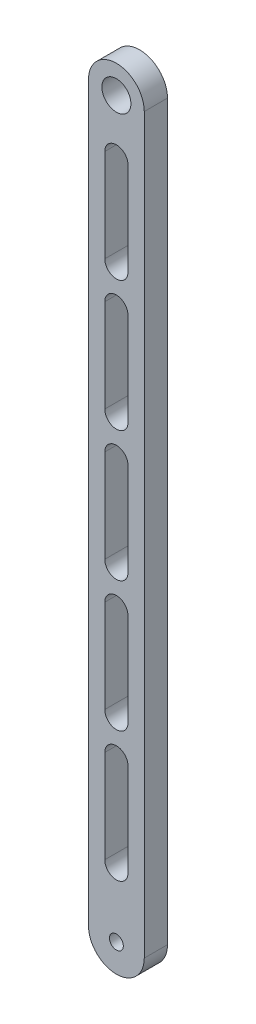
ISO-10303-21;
HEADER;
FILE_DESCRIPTION(('STEP AP214'),'2;1');
FILE_NAME('part.step','',(''),(''),'','','');
FILE_SCHEMA(('AUTOMOTIVE_DESIGN { 1 0 10303 214 1 1 1 1 }'));
ENDSEC;
DATA;
#1=APPLICATION_CONTEXT('core data for automotive mechanical design processes');
#2=APPLICATION_PROTOCOL_DEFINITION('international standard','automotive_design',2000,#1);
#3=PRODUCT_CONTEXT('',#1,'mechanical');
#4=PRODUCT('Part','Part','',(#3));
#5=PRODUCT_RELATED_PRODUCT_CATEGORY('part','',(#4));
#6=PRODUCT_DEFINITION_FORMATION('','',#4);
#7=PRODUCT_DEFINITION_CONTEXT('part definition',#1,'design');
#8=PRODUCT_DEFINITION('design','',#6,#7);
#9=PRODUCT_DEFINITION_SHAPE('','',#8);
#10=(LENGTH_UNIT() NAMED_UNIT(*) SI_UNIT(.MILLI.,.METRE.));
#11=(NAMED_UNIT(*) PLANE_ANGLE_UNIT() SI_UNIT($,.RADIAN.));
#12=(NAMED_UNIT(*) SI_UNIT($,.STERADIAN.) SOLID_ANGLE_UNIT());
#13=UNCERTAINTY_MEASURE_WITH_UNIT(LENGTH_MEASURE(1.E-05),#10,'distance_accuracy_value','');
#14=(GEOMETRIC_REPRESENTATION_CONTEXT(3) GLOBAL_UNCERTAINTY_ASSIGNED_CONTEXT((#13)) GLOBAL_UNIT_ASSIGNED_CONTEXT((#10,
#11,#12)) REPRESENTATION_CONTEXT('',''));
#15=CARTESIAN_POINT('',(0.,0.,0.));
#16=DIRECTION('',(0.,0.,1.));
#17=DIRECTION('',(1.,0.,0.));
#18=AXIS2_PLACEMENT_3D('',#15,#16,#17);
#19=CARTESIAN_POINT('',(0.,0.,6.35));
#20=DIRECTION('',(0.,0.,1.));
#21=DIRECTION('',(1.,0.,0.));
#22=AXIS2_PLACEMENT_3D('',#19,#20,#21);
#23=PLANE('',#22);
#24=CARTESIAN_POINT('',(0.,0.,6.35));
#25=DIRECTION('',(0.,0.,1.));
#26=DIRECTION('',(1.,0.,0.));
#27=AXIS2_PLACEMENT_3D('',#24,#25,#26);
#28=CIRCLE('',#27,1.89864999999999);
#29=CARTESIAN_POINT('',(1.89864999999999,0.,6.35));
#30=VERTEX_POINT('',#29);
#31=EDGE_CURVE('E808',#30,#30,#28,.T.);
#32=ORIENTED_EDGE('',*,*,#31,.F.);
#33=EDGE_LOOP('',(#32));
#34=FACE_BOUND('',#33,.T.);
#35=CARTESIAN_POINT('',(0.,0.,6.35));
#36=DIRECTION('',(0.,0.,1.));
#37=DIRECTION('',(1.,0.,0.));
#38=AXIS2_PLACEMENT_3D('',#35,#36,#37);
#39=CIRCLE('',#38,7.62);
#40=CARTESIAN_POINT('',(-7.62,0.,6.35));
#41=VERTEX_POINT('',#40);
#42=CARTESIAN_POINT('',(7.62,0.,6.35));
#43=VERTEX_POINT('',#42);
#44=EDGE_CURVE('E440',#41,#43,#39,.T.);
#45=ORIENTED_EDGE('',*,*,#44,.T.);
#46=DIRECTION('',(0.,1.,0.));
#47=VECTOR('',#46,1.);
#48=CARTESIAN_POINT('',(7.62,0.,6.35));
#49=LINE('',#48,#47);
#50=CARTESIAN_POINT('',(7.62,200.3806,6.35));
#51=VERTEX_POINT('',#50);
#52=EDGE_CURVE('E444',#43,#51,#49,.T.);
#53=ORIENTED_EDGE('',*,*,#52,.T.);
#54=CARTESIAN_POINT('',(0.,200.3806,6.35));
#55=DIRECTION('',(0.,0.,1.));
#56=DIRECTION('',(1.,0.,0.));
#57=AXIS2_PLACEMENT_3D('',#54,#55,#56);
#58=CIRCLE('',#57,7.62);
#59=CARTESIAN_POINT('',(-7.62,200.3806,6.35));
#60=VERTEX_POINT('',#59);
#61=EDGE_CURVE('E448',#51,#60,#58,.T.);
#62=ORIENTED_EDGE('',*,*,#61,.T.);
#63=DIRECTION('',(0.,-1.,0.));
#64=VECTOR('',#63,1.);
#65=CARTESIAN_POINT('',(-7.62,0.,6.35));
#66=LINE('',#65,#64);
#67=EDGE_CURVE('E451',#60,#41,#66,.T.);
#68=ORIENTED_EDGE('',*,*,#67,.T.);
#69=EDGE_LOOP('',(#45,#53,#62,#68));
#70=FACE_BOUND('',#69,.T.);
#71=CARTESIAN_POINT('',(0.,200.3806,6.35));
#72=DIRECTION('',(0.,0.,1.));
#73=DIRECTION('',(1.,0.,0.));
#74=AXIS2_PLACEMENT_3D('',#71,#72,#73);
#75=CIRCLE('',#74,3.96748);
#76=CARTESIAN_POINT('',(3.96748,200.3806,6.35));
#77=VERTEX_POINT('',#76);
#78=EDGE_CURVE('E432',#77,#77,#75,.T.);
#79=ORIENTED_EDGE('',*,*,#78,.F.);
#80=EDGE_LOOP('',(#79));
#81=FACE_BOUND('',#80,.T.);
#82=DIRECTION('',(0.,-1.,0.));
#83=VECTOR('',#82,1.);
#84=CARTESIAN_POINT('',(-3.175,185.5216,6.35));
#85=LINE('',#84,#83);
#86=CARTESIAN_POINT('',(-3.175,185.5216,6.35));
#87=VERTEX_POINT('',#86);
#88=CARTESIAN_POINT('',(-3.17499999999996,160.1216,6.35));
#89=VERTEX_POINT('',#88);
#90=EDGE_CURVE('E392',#87,#89,#85,.T.);
#91=ORIENTED_EDGE('',*,*,#90,.F.);
#92=CARTESIAN_POINT('',(0.,185.5216,6.35));
#93=DIRECTION('',(0.,0.,1.));
#94=DIRECTION('',(1.,0.,0.));
#95=AXIS2_PLACEMENT_3D('',#92,#93,#94);
#96=CIRCLE('',#95,3.175);
#97=CARTESIAN_POINT('',(3.175,185.5216,6.35));
#98=VERTEX_POINT('',#97);
#99=EDGE_CURVE('E389',#98,#87,#96,.T.);
#100=ORIENTED_EDGE('',*,*,#99,.F.);
#101=DIRECTION('',(0.,1.,0.));
#102=VECTOR('',#101,1.);
#103=CARTESIAN_POINT('',(3.175,185.5216,6.35));
#104=LINE('',#103,#102);
#105=CARTESIAN_POINT('',(3.17499999999997,160.1216,6.35));
#106=VERTEX_POINT('',#105);
#107=EDGE_CURVE('E400',#106,#98,#104,.T.);
#108=ORIENTED_EDGE('',*,*,#107,.F.);
#109=CARTESIAN_POINT('',(0.,160.1216,6.35));
#110=DIRECTION('',(0.,0.,1.));
#111=DIRECTION('',(1.,0.,0.));
#112=AXIS2_PLACEMENT_3D('',#109,#110,#111);
#113=CIRCLE('',#112,3.17499999999996);
#114=EDGE_CURVE('E396',#89,#106,#113,.T.);
#115=ORIENTED_EDGE('',*,*,#114,.F.);
#116=EDGE_LOOP('',(#91,#100,#108,#115));
#117=FACE_BOUND('',#116,.T.);
#118=DIRECTION('',(0.,-1.,0.));
#119=VECTOR('',#118,1.);
#120=CARTESIAN_POINT('',(-3.17499999999997,149.9616,6.35));
#121=LINE('',#120,#119);
#122=CARTESIAN_POINT('',(-3.17499999999997,149.9616,6.35));
#123=VERTEX_POINT('',#122);
#124=CARTESIAN_POINT('',(-3.1749999999996,124.5616,6.35));
#125=VERTEX_POINT('',#124);
#126=EDGE_CURVE('E349',#123,#125,#121,.T.);
#127=ORIENTED_EDGE('',*,*,#126,.F.);
#128=CARTESIAN_POINT('',(3.70296917821771E-13,149.9616,6.35));
#129=DIRECTION('',(0.,0.,1.));
#130=DIRECTION('',(1.,0.,0.));
#131=AXIS2_PLACEMENT_3D('',#128,#129,#130);
#132=CIRCLE('',#131,3.17499999999997);
#133=CARTESIAN_POINT('',(3.17499999999997,149.9616,6.35));
#134=VERTEX_POINT('',#133);
#135=EDGE_CURVE('E346',#134,#123,#132,.T.);
#136=ORIENTED_EDGE('',*,*,#135,.F.);
#137=DIRECTION('',(0.,1.,0.));
#138=VECTOR('',#137,1.);
#139=CARTESIAN_POINT('',(3.17499999999997,149.9616,6.35));
#140=LINE('',#139,#138);
#141=CARTESIAN_POINT('',(3.17499999999997,124.5616,6.35));
#142=VERTEX_POINT('',#141);
#143=EDGE_CURVE('E357',#142,#134,#140,.T.);
#144=ORIENTED_EDGE('',*,*,#143,.F.);
#145=CARTESIAN_POINT('',(3.73329573301861E-13,124.5616,6.35));
#146=DIRECTION('',(0.,0.,1.));
#147=DIRECTION('',(1.,0.,0.));
#148=AXIS2_PLACEMENT_3D('',#145,#146,#147);
#149=CIRCLE('',#148,3.17499999999997);
#150=EDGE_CURVE('E353',#125,#142,#149,.T.);
#151=ORIENTED_EDGE('',*,*,#150,.F.);
#152=EDGE_LOOP('',(#127,#136,#144,#151));
#153=FACE_BOUND('',#152,.T.);
#154=DIRECTION('',(0.,-1.,0.));
#155=VECTOR('',#154,1.);
#156=CARTESIAN_POINT('',(-3.17499999999997,114.4016,6.35));
#157=LINE('',#156,#155);
#158=CARTESIAN_POINT('',(-3.17499999999997,114.4016,6.35));
#159=VERTEX_POINT('',#158);
#160=CARTESIAN_POINT('',(-3.17499999999923,89.0016,6.35));
#161=VERTEX_POINT('',#160);
#162=EDGE_CURVE('E306',#159,#161,#157,.T.);
#163=ORIENTED_EDGE('',*,*,#162,.F.);
#164=CARTESIAN_POINT('',(7.40590725040673E-13,114.4016,6.35));
#165=DIRECTION('',(0.,0.,1.));
#166=DIRECTION('',(1.,0.,0.));
#167=AXIS2_PLACEMENT_3D('',#164,#165,#166);
#168=CIRCLE('',#167,3.17499999999997);
#169=CARTESIAN_POINT('',(3.17499999999997,114.4016,6.35));
#170=VERTEX_POINT('',#169);
#171=EDGE_CURVE('E303',#170,#159,#168,.T.);
#172=ORIENTED_EDGE('',*,*,#171,.F.);
#173=DIRECTION('',(0.,1.,0.));
#174=VECTOR('',#173,1.);
#175=CARTESIAN_POINT('',(3.17499999999997,114.4016,6.35));
#176=LINE('',#175,#174);
#177=CARTESIAN_POINT('',(3.17499999999998,89.0016,6.35));
#178=VERTEX_POINT('',#177);
#179=EDGE_CURVE('E314',#178,#170,#176,.T.);
#180=ORIENTED_EDGE('',*,*,#179,.F.);
#181=CARTESIAN_POINT('',(7.43623380520762E-13,89.0016,6.35));
#182=DIRECTION('',(0.,0.,1.));
#183=DIRECTION('',(1.,0.,0.));
#184=AXIS2_PLACEMENT_3D('',#181,#182,#183);
#185=CIRCLE('',#184,3.17499999999997);
#186=EDGE_CURVE('E310',#161,#178,#185,.T.);
#187=ORIENTED_EDGE('',*,*,#186,.F.);
#188=EDGE_LOOP('',(#163,#172,#180,#187));
#189=FACE_BOUND('',#188,.T.);
#190=DIRECTION('',(0.,-1.,0.));
#191=VECTOR('',#190,1.);
#192=CARTESIAN_POINT('',(-3.17499999999998,78.8416,6.35));
#193=LINE('',#192,#191);
#194=CARTESIAN_POINT('',(-3.17499999999998,78.8416,6.35));
#195=VERTEX_POINT('',#194);
#196=CARTESIAN_POINT('',(-3.17499999999886,53.4416,6.35));
#197=VERTEX_POINT('',#196);
#198=EDGE_CURVE('E264',#195,#197,#193,.T.);
#199=ORIENTED_EDGE('',*,*,#198,.F.);
#200=CARTESIAN_POINT('',(1.11088453225957E-12,78.8416,6.35));
#201=DIRECTION('',(0.,0.,1.));
#202=DIRECTION('',(1.,0.,0.));
#203=AXIS2_PLACEMENT_3D('',#200,#201,#202);
#204=CIRCLE('',#203,3.17499999999998);
#205=CARTESIAN_POINT('',(3.17499999999998,78.8416,6.35));
#206=VERTEX_POINT('',#205);
#207=EDGE_CURVE('E261',#206,#195,#204,.T.);
#208=ORIENTED_EDGE('',*,*,#207,.F.);
#209=DIRECTION('',(0.,1.,0.));
#210=VECTOR('',#209,1.);
#211=CARTESIAN_POINT('',(3.17499999999998,78.8416,6.35));
#212=LINE('',#211,#210);
#213=CARTESIAN_POINT('',(3.17499999999998,53.4416,6.35));
#214=VERTEX_POINT('',#213);
#215=EDGE_CURVE('E271',#214,#206,#212,.T.);
#216=ORIENTED_EDGE('',*,*,#215,.F.);
#217=CARTESIAN_POINT('',(1.11391718773966E-12,53.4416,6.35));
#218=DIRECTION('',(0.,0.,1.));
#219=DIRECTION('',(1.,0.,0.));
#220=AXIS2_PLACEMENT_3D('',#217,#218,#219);
#221=CIRCLE('',#220,3.17499999999998);
#222=EDGE_CURVE('E268',#197,#214,#221,.T.);
#223=ORIENTED_EDGE('',*,*,#222,.F.);
#224=EDGE_LOOP('',(#199,#208,#216,#223));
#225=FACE_BOUND('',#224,.T.);
#226=DIRECTION('',(0.,-1.,0.));
#227=VECTOR('',#226,1.);
#228=CARTESIAN_POINT('',(-3.17499999999998,43.2816,6.35));
#229=LINE('',#228,#227);
#230=CARTESIAN_POINT('',(-3.17499999999998,43.2816,6.35));
#231=VERTEX_POINT('',#230);
#232=CARTESIAN_POINT('',(-3.1749999999985,17.8816,6.35));
#233=VERTEX_POINT('',#232);
#234=EDGE_CURVE('E218',#231,#233,#229,.T.);
#235=ORIENTED_EDGE('',*,*,#234,.F.);
#236=CARTESIAN_POINT('',(1.48117833947848E-12,43.2816,6.35));
#237=DIRECTION('',(0.,0.,1.));
#238=DIRECTION('',(1.,0.,0.));
#239=AXIS2_PLACEMENT_3D('',#236,#237,#238);
#240=CIRCLE('',#239,3.17499999999998);
#241=CARTESIAN_POINT('',(3.17499999999998,43.2816,6.35));
#242=VERTEX_POINT('',#241);
#243=EDGE_CURVE('E209',#242,#231,#240,.T.);
#244=ORIENTED_EDGE('',*,*,#243,.F.);
#245=DIRECTION('',(0.,1.,0.));
#246=VECTOR('',#245,1.);
#247=CARTESIAN_POINT('',(3.17499999999998,43.2816,6.35));
#248=LINE('',#247,#246);
#249=CARTESIAN_POINT('',(3.17499999999998,17.8816,6.35));
#250=VERTEX_POINT('',#249);
#251=EDGE_CURVE('E237',#250,#242,#248,.T.);
#252=ORIENTED_EDGE('',*,*,#251,.F.);
#253=CARTESIAN_POINT('',(1.48421099495857E-12,17.8816,6.35));
#254=DIRECTION('',(0.,0.,1.));
#255=DIRECTION('',(1.,0.,0.));
#256=AXIS2_PLACEMENT_3D('',#253,#254,#255);
#257=CIRCLE('',#256,3.17499999999998);
#258=EDGE_CURVE('E231',#233,#250,#257,.T.);
#259=ORIENTED_EDGE('',*,*,#258,.F.);
#260=EDGE_LOOP('',(#235,#244,#252,#259));
#261=FACE_BOUND('',#260,.T.);
#262=ADVANCED_FACE('F47',(#34,#70,#81,#117,#153,#189,#225,#261),#23,.T.);
#263=CARTESIAN_POINT('',(0.,0.,0.));
#264=DIRECTION('',(0.,0.,1.));
#265=DIRECTION('',(1.,0.,0.));
#266=AXIS2_PLACEMENT_3D('',#263,#264,#265);
#267=PLANE('',#266);
#268=CARTESIAN_POINT('',(0.,0.,0.));
#269=DIRECTION('',(0.,0.,1.));
#270=DIRECTION('',(1.,0.,0.));
#271=AXIS2_PLACEMENT_3D('',#268,#269,#270);
#272=CIRCLE('',#271,1.89864999999999);
#273=CARTESIAN_POINT('',(1.89864999999999,0.,0.));
#274=VERTEX_POINT('',#273);
#275=EDGE_CURVE('E245',#274,#274,#272,.T.);
#276=ORIENTED_EDGE('',*,*,#275,.T.);
#277=EDGE_LOOP('',(#276));
#278=FACE_BOUND('',#277,.T.);
#279=CARTESIAN_POINT('',(1.11088453225957E-12,78.8416,0.));
#280=DIRECTION('',(0.,0.,1.));
#281=DIRECTION('',(1.,0.,0.));
#282=AXIS2_PLACEMENT_3D('',#279,#280,#281);
#283=CIRCLE('',#282,3.17499999999998);
#284=CARTESIAN_POINT('',(3.17499999999998,78.8416,0.));
#285=VERTEX_POINT('',#284);
#286=CARTESIAN_POINT('',(-3.17499999999998,78.8416,0.));
#287=VERTEX_POINT('',#286);
#288=EDGE_CURVE('E227',#285,#287,#283,.T.);
#289=ORIENTED_EDGE('',*,*,#288,.T.);
#290=DIRECTION('',(0.,-1.,0.));
#291=VECTOR('',#290,1.);
#292=CARTESIAN_POINT('',(-3.17499999999998,78.8416,0.));
#293=LINE('',#292,#291);
#294=CARTESIAN_POINT('',(-3.17499999999886,53.4416,0.));
#295=VERTEX_POINT('',#294);
#296=EDGE_CURVE('E278',#287,#295,#293,.T.);
#297=ORIENTED_EDGE('',*,*,#296,.T.);
#298=CARTESIAN_POINT('',(1.11391718773966E-12,53.4416,0.));
#299=DIRECTION('',(0.,0.,1.));
#300=DIRECTION('',(1.,0.,0.));
#301=AXIS2_PLACEMENT_3D('',#298,#299,#300);
#302=CIRCLE('',#301,3.17499999999998);
#303=CARTESIAN_POINT('',(3.17499999999998,53.4416,0.));
#304=VERTEX_POINT('',#303);
#305=EDGE_CURVE('E282',#295,#304,#302,.T.);
#306=ORIENTED_EDGE('',*,*,#305,.T.);
#307=DIRECTION('',(0.,1.,0.));
#308=VECTOR('',#307,1.);
#309=CARTESIAN_POINT('',(3.17499999999998,78.8416,0.));
#310=LINE('',#309,#308);
#311=EDGE_CURVE('E265',#304,#285,#310,.T.);
#312=ORIENTED_EDGE('',*,*,#311,.T.);
#313=EDGE_LOOP('',(#289,#297,#306,#312));
#314=FACE_BOUND('',#313,.T.);
#315=CARTESIAN_POINT('',(3.70296917821771E-13,149.9616,0.));
#316=DIRECTION('',(0.,0.,1.));
#317=DIRECTION('',(1.,0.,0.));
#318=AXIS2_PLACEMENT_3D('',#315,#316,#317);
#319=CIRCLE('',#318,3.17499999999997);
#320=CARTESIAN_POINT('',(3.17499999999997,149.9616,0.));
#321=VERTEX_POINT('',#320);
#322=CARTESIAN_POINT('',(-3.17499999999997,149.9616,0.));
#323=VERTEX_POINT('',#322);
#324=EDGE_CURVE('E345',#321,#323,#319,.T.);
#325=ORIENTED_EDGE('',*,*,#324,.T.);
#326=DIRECTION('',(0.,-1.,0.));
#327=VECTOR('',#326,1.);
#328=CARTESIAN_POINT('',(-3.17499999999997,149.9616,0.));
#329=LINE('',#328,#327);
#330=CARTESIAN_POINT('',(-3.1749999999996,124.5616,0.));
#331=VERTEX_POINT('',#330);
#332=EDGE_CURVE('E364',#323,#331,#329,.T.);
#333=ORIENTED_EDGE('',*,*,#332,.T.);
#334=CARTESIAN_POINT('',(3.73329573301861E-13,124.5616,0.));
#335=DIRECTION('',(0.,0.,1.));
#336=DIRECTION('',(1.,0.,0.));
#337=AXIS2_PLACEMENT_3D('',#334,#335,#336);
#338=CIRCLE('',#337,3.17499999999997);
#339=CARTESIAN_POINT('',(3.17499999999997,124.5616,0.));
#340=VERTEX_POINT('',#339);
#341=EDGE_CURVE('E368',#331,#340,#338,.T.);
#342=ORIENTED_EDGE('',*,*,#341,.T.);
#343=DIRECTION('',(0.,1.,0.));
#344=VECTOR('',#343,1.);
#345=CARTESIAN_POINT('',(3.17499999999997,149.9616,0.));
#346=LINE('',#345,#344);
#347=EDGE_CURVE('E350',#340,#321,#346,.T.);
#348=ORIENTED_EDGE('',*,*,#347,.T.);
#349=EDGE_LOOP('',(#325,#333,#342,#348));
#350=FACE_BOUND('',#349,.T.);
#351=CARTESIAN_POINT('',(0.,200.3806,0.));
#352=DIRECTION('',(0.,0.,1.));
#353=DIRECTION('',(1.,0.,0.));
#354=AXIS2_PLACEMENT_3D('',#351,#352,#353);
#355=CIRCLE('',#354,3.96748);
#356=CARTESIAN_POINT('',(3.96748,200.3806,0.));
#357=VERTEX_POINT('',#356);
#358=EDGE_CURVE('E431',#357,#357,#355,.T.);
#359=ORIENTED_EDGE('',*,*,#358,.T.);
#360=EDGE_LOOP('',(#359));
#361=FACE_BOUND('',#360,.T.);
#362=CARTESIAN_POINT('',(0.,0.,0.));
#363=DIRECTION('',(0.,0.,1.));
#364=DIRECTION('',(1.,0.,0.));
#365=AXIS2_PLACEMENT_3D('',#362,#363,#364);
#366=CIRCLE('',#365,7.62);
#367=CARTESIAN_POINT('',(-7.62,0.,0.));
#368=VERTEX_POINT('',#367);
#369=CARTESIAN_POINT('',(7.62,0.,0.));
#370=VERTEX_POINT('',#369);
#371=EDGE_CURVE('E436',#368,#370,#366,.T.);
#372=ORIENTED_EDGE('',*,*,#371,.F.);
#373=DIRECTION('',(0.,-1.,0.));
#374=VECTOR('',#373,1.);
#375=CARTESIAN_POINT('',(-7.62,0.,0.));
#376=LINE('',#375,#374);
#377=CARTESIAN_POINT('',(-7.62,200.3806,0.));
#378=VERTEX_POINT('',#377);
#379=EDGE_CURVE('E445',#378,#368,#376,.T.);
#380=ORIENTED_EDGE('',*,*,#379,.F.);
#381=CARTESIAN_POINT('',(0.,200.3806,0.));
#382=DIRECTION('',(0.,0.,1.));
#383=DIRECTION('',(1.,0.,0.));
#384=AXIS2_PLACEMENT_3D('',#381,#382,#383);
#385=CIRCLE('',#384,7.62);
#386=CARTESIAN_POINT('',(7.62,200.3806,0.));
#387=VERTEX_POINT('',#386);
#388=EDGE_CURVE('E461',#387,#378,#385,.T.);
#389=ORIENTED_EDGE('',*,*,#388,.F.);
#390=DIRECTION('',(0.,1.,0.));
#391=VECTOR('',#390,1.);
#392=CARTESIAN_POINT('',(7.62,0.,0.));
#393=LINE('',#392,#391);
#394=EDGE_CURVE('E458',#370,#387,#393,.T.);
#395=ORIENTED_EDGE('',*,*,#394,.F.);
#396=EDGE_LOOP('',(#372,#380,#389,#395));
#397=FACE_BOUND('',#396,.T.);
#398=CARTESIAN_POINT('',(0.,185.5216,0.));
#399=DIRECTION('',(0.,0.,1.));
#400=DIRECTION('',(1.,0.,0.));
#401=AXIS2_PLACEMENT_3D('',#398,#399,#400);
#402=CIRCLE('',#401,3.175);
#403=CARTESIAN_POINT('',(3.175,185.5216,0.));
#404=VERTEX_POINT('',#403);
#405=CARTESIAN_POINT('',(-3.175,185.5216,0.));
#406=VERTEX_POINT('',#405);
#407=EDGE_CURVE('E388',#404,#406,#402,.T.);
#408=ORIENTED_EDGE('',*,*,#407,.T.);
#409=DIRECTION('',(0.,-1.,0.));
#410=VECTOR('',#409,1.);
#411=CARTESIAN_POINT('',(-3.175,185.5216,0.));
#412=LINE('',#411,#410);
#413=CARTESIAN_POINT('',(-3.17499999999996,160.1216,0.));
#414=VERTEX_POINT('',#413);
#415=EDGE_CURVE('E407',#406,#414,#412,.T.);
#416=ORIENTED_EDGE('',*,*,#415,.T.);
#417=CARTESIAN_POINT('',(0.,160.1216,0.));
#418=DIRECTION('',(0.,0.,1.));
#419=DIRECTION('',(1.,0.,0.));
#420=AXIS2_PLACEMENT_3D('',#417,#418,#419);
#421=CIRCLE('',#420,3.17499999999996);
#422=CARTESIAN_POINT('',(3.17499999999997,160.1216,0.));
#423=VERTEX_POINT('',#422);
#424=EDGE_CURVE('E411',#414,#423,#421,.T.);
#425=ORIENTED_EDGE('',*,*,#424,.T.);
#426=DIRECTION('',(0.,1.,0.));
#427=VECTOR('',#426,1.);
#428=CARTESIAN_POINT('',(3.175,185.5216,0.));
#429=LINE('',#428,#427);
#430=EDGE_CURVE('E393',#423,#404,#429,.T.);
#431=ORIENTED_EDGE('',*,*,#430,.T.);
#432=EDGE_LOOP('',(#408,#416,#425,#431));
#433=FACE_BOUND('',#432,.T.);
#434=CARTESIAN_POINT('',(7.40590725040673E-13,114.4016,0.));
#435=DIRECTION('',(0.,0.,1.));
#436=DIRECTION('',(1.,0.,0.));
#437=AXIS2_PLACEMENT_3D('',#434,#435,#436);
#438=CIRCLE('',#437,3.17499999999997);
#439=CARTESIAN_POINT('',(3.17499999999997,114.4016,0.));
#440=VERTEX_POINT('',#439);
#441=CARTESIAN_POINT('',(-3.17499999999997,114.4016,0.));
#442=VERTEX_POINT('',#441);
#443=EDGE_CURVE('E302',#440,#442,#438,.T.);
#444=ORIENTED_EDGE('',*,*,#443,.T.);
#445=DIRECTION('',(0.,-1.,0.));
#446=VECTOR('',#445,1.);
#447=CARTESIAN_POINT('',(-3.17499999999997,114.4016,0.));
#448=LINE('',#447,#446);
#449=CARTESIAN_POINT('',(-3.17499999999923,89.0016,0.));
#450=VERTEX_POINT('',#449);
#451=EDGE_CURVE('E321',#442,#450,#448,.T.);
#452=ORIENTED_EDGE('',*,*,#451,.T.);
#453=CARTESIAN_POINT('',(7.43623380520762E-13,89.0016,0.));
#454=DIRECTION('',(0.,0.,1.));
#455=DIRECTION('',(1.,0.,0.));
#456=AXIS2_PLACEMENT_3D('',#453,#454,#455);
#457=CIRCLE('',#456,3.17499999999997);
#458=CARTESIAN_POINT('',(3.17499999999998,89.0016,0.));
#459=VERTEX_POINT('',#458);
#460=EDGE_CURVE('E325',#450,#459,#457,.T.);
#461=ORIENTED_EDGE('',*,*,#460,.T.);
#462=DIRECTION('',(0.,1.,0.));
#463=VECTOR('',#462,1.);
#464=CARTESIAN_POINT('',(3.17499999999997,114.4016,0.));
#465=LINE('',#464,#463);
#466=EDGE_CURVE('E307',#459,#440,#465,.T.);
#467=ORIENTED_EDGE('',*,*,#466,.T.);
#468=EDGE_LOOP('',(#444,#452,#461,#467));
#469=FACE_BOUND('',#468,.T.);
#470=CARTESIAN_POINT('',(1.48117833947848E-12,43.2816,0.));
#471=DIRECTION('',(0.,0.,1.));
#472=DIRECTION('',(1.,0.,0.));
#473=AXIS2_PLACEMENT_3D('',#470,#471,#472);
#474=CIRCLE('',#473,3.17499999999998);
#475=CARTESIAN_POINT('',(3.17499999999998,43.2816,0.));
#476=VERTEX_POINT('',#475);
#477=CARTESIAN_POINT('',(-3.17499999999998,43.2816,0.));
#478=VERTEX_POINT('',#477);
#479=EDGE_CURVE('E71',#476,#478,#474,.T.);
#480=ORIENTED_EDGE('',*,*,#479,.T.);
#481=DIRECTION('',(0.,-1.,0.));
#482=VECTOR('',#481,1.);
#483=CARTESIAN_POINT('',(-3.17499999999998,43.2816,0.));
#484=LINE('',#483,#482);
#485=CARTESIAN_POINT('',(-3.1749999999985,17.8816,0.));
#486=VERTEX_POINT('',#485);
#487=EDGE_CURVE('E225',#478,#486,#484,.T.);
#488=ORIENTED_EDGE('',*,*,#487,.T.);
#489=CARTESIAN_POINT('',(1.48421099495857E-12,17.8816,0.));
#490=DIRECTION('',(0.,0.,1.));
#491=DIRECTION('',(1.,0.,0.));
#492=AXIS2_PLACEMENT_3D('',#489,#490,#491);
#493=CIRCLE('',#492,3.17499999999998);
#494=CARTESIAN_POINT('',(3.17499999999998,17.8816,0.));
#495=VERTEX_POINT('',#494);
#496=EDGE_CURVE('E248',#486,#495,#493,.T.);
#497=ORIENTED_EDGE('',*,*,#496,.T.);
#498=DIRECTION('',(0.,1.,0.));
#499=VECTOR('',#498,1.);
#500=CARTESIAN_POINT('',(3.17499999999998,43.2816,0.));
#501=LINE('',#500,#499);
#502=EDGE_CURVE('E219',#495,#476,#501,.T.);
#503=ORIENTED_EDGE('',*,*,#502,.T.);
#504=EDGE_LOOP('',(#480,#488,#497,#503));
#505=FACE_BOUND('',#504,.T.);
#506=ADVANCED_FACE('F485',(#278,#314,#350,#361,#397,#433,#469,#505),#267,.F.);
#507=CARTESIAN_POINT('',(0.,0.,6.35));
#508=DIRECTION('',(0.,0.,-1.));
#509=DIRECTION('',(-1.,0.,0.));
#510=AXIS2_PLACEMENT_3D('',#507,#508,#509);
#511=CYLINDRICAL_SURFACE('',#510,7.62);
#512=ORIENTED_EDGE('',*,*,#371,.T.);
#513=DIRECTION('',(0.,0.,-1.));
#514=VECTOR('',#513,1.);
#515=CARTESIAN_POINT('',(7.62,0.,6.35));
#516=LINE('',#515,#514);
#517=EDGE_CURVE('E11',#43,#370,#516,.T.);
#518=ORIENTED_EDGE('',*,*,#517,.F.);
#519=ORIENTED_EDGE('',*,*,#44,.F.);
#520=DIRECTION('',(0.,0.,-1.));
#521=VECTOR('',#520,1.);
#522=CARTESIAN_POINT('',(-7.62,0.,6.35));
#523=LINE('',#522,#521);
#524=EDGE_CURVE('E454',#41,#368,#523,.T.);
#525=ORIENTED_EDGE('',*,*,#524,.T.);
#526=EDGE_LOOP('',(#512,#518,#519,#525));
#527=FACE_BOUND('',#526,.T.);
#528=ADVANCED_FACE('F49',(#527),#511,.T.);
#529=CARTESIAN_POINT('',(7.62,0.,6.35));
#530=DIRECTION('',(-1.,0.,0.));
#531=DIRECTION('',(0.,0.,1.));
#532=AXIS2_PLACEMENT_3D('',#529,#530,#531);
#533=PLANE('',#532);
#534=ORIENTED_EDGE('',*,*,#394,.T.);
#535=DIRECTION('',(0.,0.,-1.));
#536=VECTOR('',#535,1.);
#537=CARTESIAN_POINT('',(7.62,200.3806,6.35));
#538=LINE('',#537,#536);
#539=EDGE_CURVE('E56',#51,#387,#538,.T.);
#540=ORIENTED_EDGE('',*,*,#539,.F.);
#541=ORIENTED_EDGE('',*,*,#52,.F.);
#542=ORIENTED_EDGE('',*,*,#517,.T.);
#543=EDGE_LOOP('',(#534,#540,#541,#542));
#544=FACE_BOUND('',#543,.T.);
#545=ADVANCED_FACE('F496',(#544),#533,.F.);
#546=CARTESIAN_POINT('',(0.,200.3806,6.35));
#547=DIRECTION('',(0.,0.,-1.));
#548=DIRECTION('',(-1.,0.,0.));
#549=AXIS2_PLACEMENT_3D('',#546,#547,#548);
#550=CYLINDRICAL_SURFACE('',#549,7.62);
#551=ORIENTED_EDGE('',*,*,#388,.T.);
#552=DIRECTION('',(0.,0.,-1.));
#553=VECTOR('',#552,1.);
#554=CARTESIAN_POINT('',(-7.62,200.3806,6.35));
#555=LINE('',#554,#553);
#556=EDGE_CURVE('E469',#60,#378,#555,.T.);
#557=ORIENTED_EDGE('',*,*,#556,.F.);
#558=ORIENTED_EDGE('',*,*,#61,.F.);
#559=ORIENTED_EDGE('',*,*,#539,.T.);
#560=EDGE_LOOP('',(#551,#557,#558,#559));
#561=FACE_BOUND('',#560,.T.);
#562=ADVANCED_FACE('F479',(#561),#550,.T.);
#563=CARTESIAN_POINT('',(-7.62,0.,6.35));
#564=DIRECTION('',(1.,0.,0.));
#565=DIRECTION('',(0.,0.,-1.));
#566=AXIS2_PLACEMENT_3D('',#563,#564,#565);
#567=PLANE('',#566);
#568=ORIENTED_EDGE('',*,*,#379,.T.);
#569=ORIENTED_EDGE('',*,*,#524,.F.);
#570=ORIENTED_EDGE('',*,*,#67,.F.);
#571=ORIENTED_EDGE('',*,*,#556,.T.);
#572=EDGE_LOOP('',(#568,#569,#570,#571));
#573=FACE_BOUND('',#572,.T.);
#574=ADVANCED_FACE('F489',(#573),#567,.F.);
#575=CARTESIAN_POINT('',(0.,200.3806,6.35));
#576=DIRECTION('',(0.,0.,-1.));
#577=DIRECTION('',(-1.,0.,0.));
#578=AXIS2_PLACEMENT_3D('',#575,#576,#577);
#579=CYLINDRICAL_SURFACE('',#578,3.96748);
#580=ORIENTED_EDGE('',*,*,#78,.T.);
#581=EDGE_LOOP('',(#580));
#582=FACE_BOUND('',#581,.T.);
#583=ORIENTED_EDGE('',*,*,#358,.F.);
#584=EDGE_LOOP('',(#583));
#585=FACE_BOUND('',#584,.T.);
#586=ADVANCED_FACE('F514',(#582,#585),#579,.F.);
#587=CARTESIAN_POINT('',(0.,185.5216,6.35));
#588=DIRECTION('',(0.,0.,-1.));
#589=DIRECTION('',(-1.,0.,0.));
#590=AXIS2_PLACEMENT_3D('',#587,#588,#589);
#591=CYLINDRICAL_SURFACE('',#590,3.175);
#592=ORIENTED_EDGE('',*,*,#407,.F.);
#593=DIRECTION('',(0.,0.,-1.));
#594=VECTOR('',#593,1.);
#595=CARTESIAN_POINT('',(3.175,185.5216,6.35));
#596=LINE('',#595,#594);
#597=EDGE_CURVE('E403',#98,#404,#596,.T.);
#598=ORIENTED_EDGE('',*,*,#597,.F.);
#599=ORIENTED_EDGE('',*,*,#99,.T.);
#600=DIRECTION('',(0.,0.,-1.));
#601=VECTOR('',#600,1.);
#602=CARTESIAN_POINT('',(-3.175,185.5216,6.35));
#603=LINE('',#602,#601);
#604=EDGE_CURVE('E427',#87,#406,#603,.T.);
#605=ORIENTED_EDGE('',*,*,#604,.T.);
#606=EDGE_LOOP('',(#592,#598,#599,#605));
#607=FACE_BOUND('',#606,.T.);
#608=ADVANCED_FACE('F521',(#607),#591,.F.);
#609=CARTESIAN_POINT('',(-3.175,185.5216,6.35));
#610=DIRECTION('',(1.,0.,0.));
#611=DIRECTION('',(0.,1.,0.));
#612=AXIS2_PLACEMENT_3D('',#609,#610,#611);
#613=PLANE('',#612);
#614=ORIENTED_EDGE('',*,*,#415,.F.);
#615=ORIENTED_EDGE('',*,*,#604,.F.);
#616=ORIENTED_EDGE('',*,*,#90,.T.);
#617=DIRECTION('',(0.,0.,-1.));
#618=VECTOR('',#617,1.);
#619=CARTESIAN_POINT('',(-3.17499999999996,160.1216,6.35));
#620=LINE('',#619,#618);
#621=EDGE_CURVE('E424',#89,#414,#620,.T.);
#622=ORIENTED_EDGE('',*,*,#621,.T.);
#623=EDGE_LOOP('',(#614,#615,#616,#622));
#624=FACE_BOUND('',#623,.T.);
#625=ADVANCED_FACE('F526',(#624),#613,.T.);
#626=CARTESIAN_POINT('',(0.,160.1216,6.35));
#627=DIRECTION('',(0.,0.,-1.));
#628=DIRECTION('',(-1.,0.,0.));
#629=AXIS2_PLACEMENT_3D('',#626,#627,#628);
#630=CYLINDRICAL_SURFACE('',#629,3.17499999999996);
#631=ORIENTED_EDGE('',*,*,#424,.F.);
#632=ORIENTED_EDGE('',*,*,#621,.F.);
#633=ORIENTED_EDGE('',*,*,#114,.T.);
#634=DIRECTION('',(0.,0.,-1.));
#635=VECTOR('',#634,1.);
#636=CARTESIAN_POINT('',(3.17499999999997,160.1216,6.35));
#637=LINE('',#636,#635);
#638=EDGE_CURVE('E421',#106,#423,#637,.T.);
#639=ORIENTED_EDGE('',*,*,#638,.T.);
#640=EDGE_LOOP('',(#631,#632,#633,#639));
#641=FACE_BOUND('',#640,.T.);
#642=ADVANCED_FACE('F613',(#641),#630,.F.);
#643=CARTESIAN_POINT('',(3.175,185.5216,6.35));
#644=DIRECTION('',(-1.,0.,0.));
#645=DIRECTION('',(0.,-1.,0.));
#646=AXIS2_PLACEMENT_3D('',#643,#644,#645);
#647=PLANE('',#646);
#648=ORIENTED_EDGE('',*,*,#430,.F.);
#649=ORIENTED_EDGE('',*,*,#638,.F.);
#650=ORIENTED_EDGE('',*,*,#107,.T.);
#651=ORIENTED_EDGE('',*,*,#597,.T.);
#652=EDGE_LOOP('',(#648,#649,#650,#651));
#653=FACE_BOUND('',#652,.T.);
#654=ADVANCED_FACE('F609',(#653),#647,.T.);
#655=CARTESIAN_POINT('',(3.70296917821771E-13,149.9616,6.35));
#656=DIRECTION('',(0.,0.,-1.));
#657=DIRECTION('',(-1.,0.,0.));
#658=AXIS2_PLACEMENT_3D('',#655,#656,#657);
#659=CYLINDRICAL_SURFACE('',#658,3.17499999999997);
#660=ORIENTED_EDGE('',*,*,#324,.F.);
#661=DIRECTION('',(0.,0.,-1.));
#662=VECTOR('',#661,1.);
#663=CARTESIAN_POINT('',(3.17499999999997,149.9616,6.35));
#664=LINE('',#663,#662);
#665=EDGE_CURVE('E360',#134,#321,#664,.T.);
#666=ORIENTED_EDGE('',*,*,#665,.F.);
#667=ORIENTED_EDGE('',*,*,#135,.T.);
#668=DIRECTION('',(0.,0.,-1.));
#669=VECTOR('',#668,1.);
#670=CARTESIAN_POINT('',(-3.17499999999997,149.9616,6.35));
#671=LINE('',#670,#669);
#672=EDGE_CURVE('E384',#123,#323,#671,.T.);
#673=ORIENTED_EDGE('',*,*,#672,.T.);
#674=EDGE_LOOP('',(#660,#666,#667,#673));
#675=FACE_BOUND('',#674,.T.);
#676=ADVANCED_FACE('F605',(#675),#659,.F.);
#677=CARTESIAN_POINT('',(-3.17499999999997,149.9616,6.35));
#678=DIRECTION('',(1.,0.,0.));
#679=DIRECTION('',(0.,1.,0.));
#680=AXIS2_PLACEMENT_3D('',#677,#678,#679);
#681=PLANE('',#680);
#682=ORIENTED_EDGE('',*,*,#332,.F.);
#683=ORIENTED_EDGE('',*,*,#672,.F.);
#684=ORIENTED_EDGE('',*,*,#126,.T.);
#685=DIRECTION('',(0.,0.,-1.));
#686=VECTOR('',#685,1.);
#687=CARTESIAN_POINT('',(-3.1749999999996,124.5616,6.35));
#688=LINE('',#687,#686);
#689=EDGE_CURVE('E381',#125,#331,#688,.T.);
#690=ORIENTED_EDGE('',*,*,#689,.T.);
#691=EDGE_LOOP('',(#682,#683,#684,#690));
#692=FACE_BOUND('',#691,.T.);
#693=ADVANCED_FACE('F601',(#692),#681,.T.);
#694=CARTESIAN_POINT('',(3.73329573301861E-13,124.5616,6.35));
#695=DIRECTION('',(0.,0.,-1.));
#696=DIRECTION('',(-1.,0.,0.));
#697=AXIS2_PLACEMENT_3D('',#694,#695,#696);
#698=CYLINDRICAL_SURFACE('',#697,3.17499999999997);
#699=ORIENTED_EDGE('',*,*,#341,.F.);
#700=ORIENTED_EDGE('',*,*,#689,.F.);
#701=ORIENTED_EDGE('',*,*,#150,.T.);
#702=DIRECTION('',(0.,0.,-1.));
#703=VECTOR('',#702,1.);
#704=CARTESIAN_POINT('',(3.17499999999997,124.5616,6.35));
#705=LINE('',#704,#703);
#706=EDGE_CURVE('E378',#142,#340,#705,.T.);
#707=ORIENTED_EDGE('',*,*,#706,.T.);
#708=EDGE_LOOP('',(#699,#700,#701,#707));
#709=FACE_BOUND('',#708,.T.);
#710=ADVANCED_FACE('F597',(#709),#698,.F.);
#711=CARTESIAN_POINT('',(3.17499999999997,149.9616,6.35));
#712=DIRECTION('',(-1.,0.,0.));
#713=DIRECTION('',(0.,-1.,0.));
#714=AXIS2_PLACEMENT_3D('',#711,#712,#713);
#715=PLANE('',#714);
#716=ORIENTED_EDGE('',*,*,#347,.F.);
#717=ORIENTED_EDGE('',*,*,#706,.F.);
#718=ORIENTED_EDGE('',*,*,#143,.T.);
#719=ORIENTED_EDGE('',*,*,#665,.T.);
#720=EDGE_LOOP('',(#716,#717,#718,#719));
#721=FACE_BOUND('',#720,.T.);
#722=ADVANCED_FACE('F593',(#721),#715,.T.);
#723=CARTESIAN_POINT('',(7.40590725040673E-13,114.4016,6.35));
#724=DIRECTION('',(0.,0.,-1.));
#725=DIRECTION('',(-1.,0.,0.));
#726=AXIS2_PLACEMENT_3D('',#723,#724,#725);
#727=CYLINDRICAL_SURFACE('',#726,3.17499999999997);
#728=ORIENTED_EDGE('',*,*,#443,.F.);
#729=DIRECTION('',(0.,0.,-1.));
#730=VECTOR('',#729,1.);
#731=CARTESIAN_POINT('',(3.17499999999997,114.4016,6.35));
#732=LINE('',#731,#730);
#733=EDGE_CURVE('E317',#170,#440,#732,.T.);
#734=ORIENTED_EDGE('',*,*,#733,.F.);
#735=ORIENTED_EDGE('',*,*,#171,.T.);
#736=DIRECTION('',(0.,0.,-1.));
#737=VECTOR('',#736,1.);
#738=CARTESIAN_POINT('',(-3.17499999999997,114.4016,6.35));
#739=LINE('',#738,#737);
#740=EDGE_CURVE('E341',#159,#442,#739,.T.);
#741=ORIENTED_EDGE('',*,*,#740,.T.);
#742=EDGE_LOOP('',(#728,#734,#735,#741));
#743=FACE_BOUND('',#742,.T.);
#744=ADVANCED_FACE('F589',(#743),#727,.F.);
#745=CARTESIAN_POINT('',(-3.17499999999997,114.4016,6.35));
#746=DIRECTION('',(1.,0.,0.));
#747=DIRECTION('',(0.,1.,0.));
#748=AXIS2_PLACEMENT_3D('',#745,#746,#747);
#749=PLANE('',#748);
#750=ORIENTED_EDGE('',*,*,#451,.F.);
#751=ORIENTED_EDGE('',*,*,#740,.F.);
#752=ORIENTED_EDGE('',*,*,#162,.T.);
#753=DIRECTION('',(0.,0.,-1.));
#754=VECTOR('',#753,1.);
#755=CARTESIAN_POINT('',(-3.17499999999923,89.0016,6.35));
#756=LINE('',#755,#754);
#757=EDGE_CURVE('E338',#161,#450,#756,.T.);
#758=ORIENTED_EDGE('',*,*,#757,.T.);
#759=EDGE_LOOP('',(#750,#751,#752,#758));
#760=FACE_BOUND('',#759,.T.);
#761=ADVANCED_FACE('F585',(#760),#749,.T.);
#762=CARTESIAN_POINT('',(7.43623380520762E-13,89.0016,6.35));
#763=DIRECTION('',(0.,0.,-1.));
#764=DIRECTION('',(-1.,0.,0.));
#765=AXIS2_PLACEMENT_3D('',#762,#763,#764);
#766=CYLINDRICAL_SURFACE('',#765,3.17499999999997);
#767=ORIENTED_EDGE('',*,*,#460,.F.);
#768=ORIENTED_EDGE('',*,*,#757,.F.);
#769=ORIENTED_EDGE('',*,*,#186,.T.);
#770=DIRECTION('',(0.,0.,-1.));
#771=VECTOR('',#770,1.);
#772=CARTESIAN_POINT('',(3.17499999999998,89.0016,6.35));
#773=LINE('',#772,#771);
#774=EDGE_CURVE('E335',#178,#459,#773,.T.);
#775=ORIENTED_EDGE('',*,*,#774,.T.);
#776=EDGE_LOOP('',(#767,#768,#769,#775));
#777=FACE_BOUND('',#776,.T.);
#778=ADVANCED_FACE('F581',(#777),#766,.F.);
#779=CARTESIAN_POINT('',(3.17499999999997,114.4016,6.35));
#780=DIRECTION('',(-1.,0.,0.));
#781=DIRECTION('',(0.,-1.,0.));
#782=AXIS2_PLACEMENT_3D('',#779,#780,#781);
#783=PLANE('',#782);
#784=ORIENTED_EDGE('',*,*,#466,.F.);
#785=ORIENTED_EDGE('',*,*,#774,.F.);
#786=ORIENTED_EDGE('',*,*,#179,.T.);
#787=ORIENTED_EDGE('',*,*,#733,.T.);
#788=EDGE_LOOP('',(#784,#785,#786,#787));
#789=FACE_BOUND('',#788,.T.);
#790=ADVANCED_FACE('F578',(#789),#783,.T.);
#791=CARTESIAN_POINT('',(1.11088453225957E-12,78.8416,6.35));
#792=DIRECTION('',(0.,0.,-1.));
#793=DIRECTION('',(-1.,0.,0.));
#794=AXIS2_PLACEMENT_3D('',#791,#792,#793);
#795=CYLINDRICAL_SURFACE('',#794,3.17499999999998);
#796=ORIENTED_EDGE('',*,*,#288,.F.);
#797=DIRECTION('',(0.,0.,-1.));
#798=VECTOR('',#797,1.);
#799=CARTESIAN_POINT('',(3.17499999999998,78.8416,6.35));
#800=LINE('',#799,#798);
#801=EDGE_CURVE('E274',#206,#285,#800,.T.);
#802=ORIENTED_EDGE('',*,*,#801,.F.);
#803=ORIENTED_EDGE('',*,*,#207,.T.);
#804=DIRECTION('',(0.,0.,-1.));
#805=VECTOR('',#804,1.);
#806=CARTESIAN_POINT('',(-3.17499999999998,78.8416,6.35));
#807=LINE('',#806,#805);
#808=EDGE_CURVE('E298',#195,#287,#807,.T.);
#809=ORIENTED_EDGE('',*,*,#808,.T.);
#810=EDGE_LOOP('',(#796,#802,#803,#809));
#811=FACE_BOUND('',#810,.T.);
#812=ADVANCED_FACE('F560',(#811),#795,.F.);
#813=CARTESIAN_POINT('',(-3.17499999999998,78.8416,6.35));
#814=DIRECTION('',(1.,0.,0.));
#815=DIRECTION('',(0.,1.,0.));
#816=AXIS2_PLACEMENT_3D('',#813,#814,#815);
#817=PLANE('',#816);
#818=ORIENTED_EDGE('',*,*,#296,.F.);
#819=ORIENTED_EDGE('',*,*,#808,.F.);
#820=ORIENTED_EDGE('',*,*,#198,.T.);
#821=DIRECTION('',(0.,0.,-1.));
#822=VECTOR('',#821,1.);
#823=CARTESIAN_POINT('',(-3.17499999999886,53.4416,6.35));
#824=LINE('',#823,#822);
#825=EDGE_CURVE('E295',#197,#295,#824,.T.);
#826=ORIENTED_EDGE('',*,*,#825,.T.);
#827=EDGE_LOOP('',(#818,#819,#820,#826));
#828=FACE_BOUND('',#827,.T.);
#829=ADVANCED_FACE('F552',(#828),#817,.T.);
#830=CARTESIAN_POINT('',(1.11391718773966E-12,53.4416,6.35));
#831=DIRECTION('',(0.,0.,-1.));
#832=DIRECTION('',(-1.,0.,0.));
#833=AXIS2_PLACEMENT_3D('',#830,#831,#832);
#834=CYLINDRICAL_SURFACE('',#833,3.17499999999998);
#835=ORIENTED_EDGE('',*,*,#305,.F.);
#836=ORIENTED_EDGE('',*,*,#825,.F.);
#837=ORIENTED_EDGE('',*,*,#222,.T.);
#838=DIRECTION('',(0.,0.,-1.));
#839=VECTOR('',#838,1.);
#840=CARTESIAN_POINT('',(3.17499999999998,53.4416,6.35));
#841=LINE('',#840,#839);
#842=EDGE_CURVE('E292',#214,#304,#841,.T.);
#843=ORIENTED_EDGE('',*,*,#842,.T.);
#844=EDGE_LOOP('',(#835,#836,#837,#843));
#845=FACE_BOUND('',#844,.T.);
#846=ADVANCED_FACE('F555',(#845),#834,.F.);
#847=CARTESIAN_POINT('',(3.17499999999998,78.8416,6.35));
#848=DIRECTION('',(-1.,0.,0.));
#849=DIRECTION('',(0.,-1.,0.));
#850=AXIS2_PLACEMENT_3D('',#847,#848,#849);
#851=PLANE('',#850);
#852=ORIENTED_EDGE('',*,*,#311,.F.);
#853=ORIENTED_EDGE('',*,*,#842,.F.);
#854=ORIENTED_EDGE('',*,*,#215,.T.);
#855=ORIENTED_EDGE('',*,*,#801,.T.);
#856=EDGE_LOOP('',(#852,#853,#854,#855));
#857=FACE_BOUND('',#856,.T.);
#858=ADVANCED_FACE('F563',(#857),#851,.T.);
#859=CARTESIAN_POINT('',(1.48117833947848E-12,43.2816,6.35));
#860=DIRECTION('',(0.,0.,-1.));
#861=DIRECTION('',(-1.,0.,0.));
#862=AXIS2_PLACEMENT_3D('',#859,#860,#861);
#863=CYLINDRICAL_SURFACE('',#862,3.17499999999998);
#864=ORIENTED_EDGE('',*,*,#479,.F.);
#865=DIRECTION('',(0.,0.,-1.));
#866=VECTOR('',#865,1.);
#867=CARTESIAN_POINT('',(3.17499999999998,43.2816,6.35));
#868=LINE('',#867,#866);
#869=EDGE_CURVE('E213',#242,#476,#868,.T.);
#870=ORIENTED_EDGE('',*,*,#869,.F.);
#871=ORIENTED_EDGE('',*,*,#243,.T.);
#872=DIRECTION('',(0.,0.,-1.));
#873=VECTOR('',#872,1.);
#874=CARTESIAN_POINT('',(-3.17499999999998,43.2816,6.35));
#875=LINE('',#874,#873);
#876=EDGE_CURVE('E212',#231,#478,#875,.T.);
#877=ORIENTED_EDGE('',*,*,#876,.T.);
#878=EDGE_LOOP('',(#864,#870,#871,#877));
#879=FACE_BOUND('',#878,.T.);
#880=ADVANCED_FACE('F211',(#879),#863,.F.);
#881=CARTESIAN_POINT('',(-3.17499999999998,43.2816,6.35));
#882=DIRECTION('',(1.,0.,0.));
#883=DIRECTION('',(0.,1.,0.));
#884=AXIS2_PLACEMENT_3D('',#881,#882,#883);
#885=PLANE('',#884);
#886=ORIENTED_EDGE('',*,*,#487,.F.);
#887=ORIENTED_EDGE('',*,*,#876,.F.);
#888=ORIENTED_EDGE('',*,*,#234,.T.);
#889=DIRECTION('',(0.,0.,-1.));
#890=VECTOR('',#889,1.);
#891=CARTESIAN_POINT('',(-3.1749999999985,17.8816,6.35));
#892=LINE('',#891,#890);
#893=EDGE_CURVE('E228',#233,#486,#892,.T.);
#894=ORIENTED_EDGE('',*,*,#893,.T.);
#895=EDGE_LOOP('',(#886,#887,#888,#894));
#896=FACE_BOUND('',#895,.T.);
#897=ADVANCED_FACE('F222',(#896),#885,.T.);
#898=CARTESIAN_POINT('',(1.48421099495857E-12,17.8816,6.35));
#899=DIRECTION('',(0.,0.,-1.));
#900=DIRECTION('',(-1.,0.,0.));
#901=AXIS2_PLACEMENT_3D('',#898,#899,#900);
#902=CYLINDRICAL_SURFACE('',#901,3.17499999999998);
#903=ORIENTED_EDGE('',*,*,#496,.F.);
#904=ORIENTED_EDGE('',*,*,#893,.F.);
#905=ORIENTED_EDGE('',*,*,#258,.T.);
#906=DIRECTION('',(0.,0.,-1.));
#907=VECTOR('',#906,1.);
#908=CARTESIAN_POINT('',(3.17499999999998,17.8816,6.35));
#909=LINE('',#908,#907);
#910=EDGE_CURVE('E63',#250,#495,#909,.T.);
#911=ORIENTED_EDGE('',*,*,#910,.T.);
#912=EDGE_LOOP('',(#903,#904,#905,#911));
#913=FACE_BOUND('',#912,.T.);
#914=ADVANCED_FACE('F633',(#913),#902,.F.);
#915=CARTESIAN_POINT('',(3.17499999999998,43.2816,6.35));
#916=DIRECTION('',(-1.,0.,0.));
#917=DIRECTION('',(0.,-1.,0.));
#918=AXIS2_PLACEMENT_3D('',#915,#916,#917);
#919=PLANE('',#918);
#920=ORIENTED_EDGE('',*,*,#502,.F.);
#921=ORIENTED_EDGE('',*,*,#910,.F.);
#922=ORIENTED_EDGE('',*,*,#251,.T.);
#923=ORIENTED_EDGE('',*,*,#869,.T.);
#924=EDGE_LOOP('',(#920,#921,#922,#923));
#925=FACE_BOUND('',#924,.T.);
#926=ADVANCED_FACE('F631',(#925),#919,.T.);
#927=CARTESIAN_POINT('',(0.,0.,6.35));
#928=DIRECTION('',(0.,0.,1.));
#929=DIRECTION('',(1.,0.,0.));
#930=AXIS2_PLACEMENT_3D('',#927,#928,#929);
#931=CYLINDRICAL_SURFACE('',#930,1.89864999999999);
#932=ORIENTED_EDGE('',*,*,#275,.F.);
#933=EDGE_LOOP('',(#932));
#934=FACE_BOUND('',#933,.T.);
#935=ORIENTED_EDGE('',*,*,#31,.T.);
#936=EDGE_LOOP('',(#935));
#937=FACE_BOUND('',#936,.T.);
#938=ADVANCED_FACE('F632',(#934,#937),#931,.F.);
#939=CLOSED_SHELL('',(#262,#506,#528,#545,#562,#574,#586,#608,#625,#642,#654,#676,#693,#710,
#722,#744,#761,#778,#790,#812,#829,#846,#858,#880,#897,#914,#926,#938));
#940=MANIFOLD_SOLID_BREP('B2',#939);
#941=ADVANCED_BREP_SHAPE_REPRESENTATION('',(#18,#940),#14);
#942=SHAPE_DEFINITION_REPRESENTATION(#9,#941);
ENDSEC;
END-ISO-10303-21;
